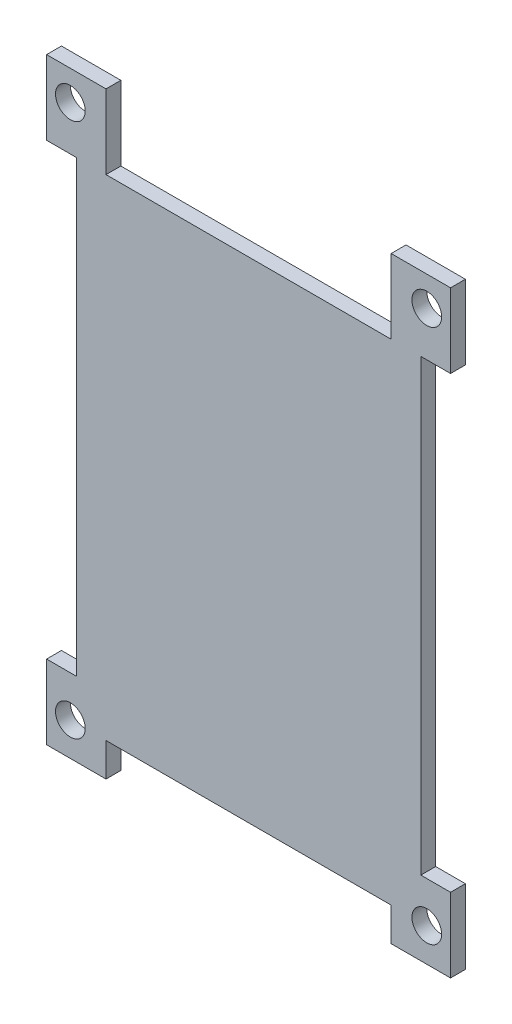
ISO-10303-21;
HEADER;
FILE_DESCRIPTION(('STEP AP214'),'2;1');
FILE_NAME('part.step','',(''),(''),'','','');
FILE_SCHEMA(('AUTOMOTIVE_DESIGN { 1 0 10303 214 1 1 1 1 }'));
ENDSEC;
DATA;
#1=APPLICATION_CONTEXT('core data for automotive mechanical design processes');
#2=APPLICATION_PROTOCOL_DEFINITION('international standard','automotive_design',2000,#1);
#3=PRODUCT_CONTEXT('',#1,'mechanical');
#4=PRODUCT('Part','Part','',(#3));
#5=PRODUCT_RELATED_PRODUCT_CATEGORY('part','',(#4));
#6=PRODUCT_DEFINITION_FORMATION('','',#4);
#7=PRODUCT_DEFINITION_CONTEXT('part definition',#1,'design');
#8=PRODUCT_DEFINITION('design','',#6,#7);
#9=PRODUCT_DEFINITION_SHAPE('','',#8);
#10=(LENGTH_UNIT() NAMED_UNIT(*) SI_UNIT(.MILLI.,.METRE.));
#11=(NAMED_UNIT(*) PLANE_ANGLE_UNIT() SI_UNIT($,.RADIAN.));
#12=(NAMED_UNIT(*) SI_UNIT($,.STERADIAN.) SOLID_ANGLE_UNIT());
#13=UNCERTAINTY_MEASURE_WITH_UNIT(LENGTH_MEASURE(1.E-05),#10,'distance_accuracy_value','');
#14=(GEOMETRIC_REPRESENTATION_CONTEXT(3) GLOBAL_UNCERTAINTY_ASSIGNED_CONTEXT((#13)) GLOBAL_UNIT_ASSIGNED_CONTEXT((#10,
#11,#12)) REPRESENTATION_CONTEXT('',''));
#15=CARTESIAN_POINT('',(0.,0.,0.));
#16=DIRECTION('',(0.,0.,1.));
#17=DIRECTION('',(1.,0.,0.));
#18=AXIS2_PLACEMENT_3D('',#15,#16,#17);
#19=CARTESIAN_POINT('',(-27.2,33.,2.));
#20=DIRECTION('',(0.,1.,0.));
#21=DIRECTION('',(0.,0.,1.));
#22=AXIS2_PLACEMENT_3D('',#19,#20,#21);
#23=PLANE('',#22);
#24=DIRECTION('',(1.,0.,0.));
#25=VECTOR('',#24,1.);
#26=CARTESIAN_POINT('',(-27.2,33.,0.));
#27=LINE('',#26,#25);
#28=CARTESIAN_POINT('',(-27.2,33.,0.));
#29=VERTEX_POINT('',#28);
#30=CARTESIAN_POINT('',(-23.2,33.,0.));
#31=VERTEX_POINT('',#30);
#32=EDGE_CURVE('E202',#29,#31,#27,.T.);
#33=ORIENTED_EDGE('',*,*,#32,.T.);
#34=DIRECTION('',(0.,0.,-1.));
#35=VECTOR('',#34,1.);
#36=CARTESIAN_POINT('',(-23.2,33.,2.));
#37=LINE('',#36,#35);
#38=CARTESIAN_POINT('',(-23.2,33.,2.));
#39=VERTEX_POINT('',#38);
#40=EDGE_CURVE('E11',#39,#31,#37,.T.);
#41=ORIENTED_EDGE('',*,*,#40,.F.);
#42=DIRECTION('',(1.,0.,0.));
#43=VECTOR('',#42,1.);
#44=CARTESIAN_POINT('',(-27.2,33.,2.));
#45=LINE('',#44,#43);
#46=CARTESIAN_POINT('',(-27.2,33.,2.));
#47=VERTEX_POINT('',#46);
#48=EDGE_CURVE('E241',#47,#39,#45,.T.);
#49=ORIENTED_EDGE('',*,*,#48,.F.);
#50=DIRECTION('',(0.,0.,-1.));
#51=VECTOR('',#50,1.);
#52=CARTESIAN_POINT('',(-27.2,33.,2.));
#53=LINE('',#52,#51);
#54=EDGE_CURVE('E198',#47,#29,#53,.T.);
#55=ORIENTED_EDGE('',*,*,#54,.T.);
#56=EDGE_LOOP('',(#33,#41,#49,#55));
#57=FACE_BOUND('',#56,.T.);
#58=ADVANCED_FACE('F34',(#57),#23,.F.);
#59=CARTESIAN_POINT('',(-23.2,33.,2.));
#60=DIRECTION('',(1.,0.,0.));
#61=DIRECTION('',(0.,1.,0.));
#62=AXIS2_PLACEMENT_3D('',#59,#60,#61);
#63=PLANE('',#62);
#64=DIRECTION('',(0.,-1.,0.));
#65=VECTOR('',#64,1.);
#66=CARTESIAN_POINT('',(-23.2,33.,0.));
#67=LINE('',#66,#65);
#68=CARTESIAN_POINT('',(-23.2,-27.5,0.));
#69=VERTEX_POINT('',#68);
#70=EDGE_CURVE('E205',#31,#69,#67,.T.);
#71=ORIENTED_EDGE('',*,*,#70,.T.);
#72=DIRECTION('',(0.,0.,-1.));
#73=VECTOR('',#72,1.);
#74=CARTESIAN_POINT('',(-23.2,-27.5,2.));
#75=LINE('',#74,#73);
#76=CARTESIAN_POINT('',(-23.2,-27.5,2.));
#77=VERTEX_POINT('',#76);
#78=EDGE_CURVE('E42',#77,#69,#75,.T.);
#79=ORIENTED_EDGE('',*,*,#78,.F.);
#80=DIRECTION('',(0.,-1.,0.));
#81=VECTOR('',#80,1.);
#82=CARTESIAN_POINT('',(-23.2,33.,2.));
#83=LINE('',#82,#81);
#84=EDGE_CURVE('E129',#39,#77,#83,.T.);
#85=ORIENTED_EDGE('',*,*,#84,.F.);
#86=ORIENTED_EDGE('',*,*,#40,.T.);
#87=EDGE_LOOP('',(#71,#79,#85,#86));
#88=FACE_BOUND('',#87,.T.);
#89=ADVANCED_FACE('F360',(#88),#63,.F.);
#90=CARTESIAN_POINT('',(-27.2,-27.5,2.));
#91=DIRECTION('',(0.,-1.,0.));
#92=DIRECTION('',(0.,0.,-1.));
#93=AXIS2_PLACEMENT_3D('',#90,#91,#92);
#94=PLANE('',#93);
#95=DIRECTION('',(-1.,0.,0.));
#96=VECTOR('',#95,1.);
#97=CARTESIAN_POINT('',(-27.2,-27.5,0.));
#98=LINE('',#97,#96);
#99=CARTESIAN_POINT('',(-27.2,-27.5,0.));
#100=VERTEX_POINT('',#99);
#101=EDGE_CURVE('E208',#69,#100,#98,.T.);
#102=ORIENTED_EDGE('',*,*,#101,.T.);
#103=DIRECTION('',(0.,0.,-1.));
#104=VECTOR('',#103,1.);
#105=CARTESIAN_POINT('',(-27.2,-27.5,2.));
#106=LINE('',#105,#104);
#107=CARTESIAN_POINT('',(-27.2,-27.5,2.));
#108=VERTEX_POINT('',#107);
#109=EDGE_CURVE('E284',#108,#100,#106,.T.);
#110=ORIENTED_EDGE('',*,*,#109,.F.);
#111=DIRECTION('',(-1.,0.,0.));
#112=VECTOR('',#111,1.);
#113=CARTESIAN_POINT('',(-27.2,-27.5,2.));
#114=LINE('',#113,#112);
#115=EDGE_CURVE('E292',#77,#108,#114,.T.);
#116=ORIENTED_EDGE('',*,*,#115,.F.);
#117=ORIENTED_EDGE('',*,*,#78,.T.);
#118=EDGE_LOOP('',(#102,#110,#116,#117));
#119=FACE_BOUND('',#118,.T.);
#120=ADVANCED_FACE('F290',(#119),#94,.F.);
#121=CARTESIAN_POINT('',(-27.2,-37.5,2.));
#122=DIRECTION('',(1.,0.,0.));
#123=DIRECTION('',(0.,0.,-1.));
#124=AXIS2_PLACEMENT_3D('',#121,#122,#123);
#125=PLANE('',#124);
#126=DIRECTION('',(0.,-1.,0.));
#127=VECTOR('',#126,1.);
#128=CARTESIAN_POINT('',(-27.2,-37.5,0.));
#129=LINE('',#128,#127);
#130=CARTESIAN_POINT('',(-27.2,-37.5,0.));
#131=VERTEX_POINT('',#130);
#132=EDGE_CURVE('E210',#100,#131,#129,.T.);
#133=ORIENTED_EDGE('',*,*,#132,.T.);
#134=DIRECTION('',(0.,0.,-1.));
#135=VECTOR('',#134,1.);
#136=CARTESIAN_POINT('',(-27.2,-37.5,2.));
#137=LINE('',#136,#135);
#138=CARTESIAN_POINT('',(-27.2,-37.5,2.));
#139=VERTEX_POINT('',#138);
#140=EDGE_CURVE('E281',#139,#131,#137,.T.);
#141=ORIENTED_EDGE('',*,*,#140,.F.);
#142=DIRECTION('',(0.,-1.,0.));
#143=VECTOR('',#142,1.);
#144=CARTESIAN_POINT('',(-27.2,-37.5,2.));
#145=LINE('',#144,#143);
#146=EDGE_CURVE('E310',#108,#139,#145,.T.);
#147=ORIENTED_EDGE('',*,*,#146,.F.);
#148=ORIENTED_EDGE('',*,*,#109,.T.);
#149=EDGE_LOOP('',(#133,#141,#147,#148));
#150=FACE_BOUND('',#149,.T.);
#151=ADVANCED_FACE('F301',(#150),#125,.F.);
#152=CARTESIAN_POINT('',(-19.2,-37.5,2.));
#153=DIRECTION('',(0.,1.,0.));
#154=DIRECTION('',(-1.,0.,0.));
#155=AXIS2_PLACEMENT_3D('',#152,#153,#154);
#156=PLANE('',#155);
#157=DIRECTION('',(1.,0.,0.));
#158=VECTOR('',#157,1.);
#159=CARTESIAN_POINT('',(-19.2,-37.5,0.));
#160=LINE('',#159,#158);
#161=CARTESIAN_POINT('',(-19.2,-37.5,0.));
#162=VERTEX_POINT('',#161);
#163=EDGE_CURVE('E212',#131,#162,#160,.T.);
#164=ORIENTED_EDGE('',*,*,#163,.T.);
#165=DIRECTION('',(0.,0.,-1.));
#166=VECTOR('',#165,1.);
#167=CARTESIAN_POINT('',(-19.2,-37.5,2.));
#168=LINE('',#167,#166);
#169=CARTESIAN_POINT('',(-19.2,-37.5,2.));
#170=VERTEX_POINT('',#169);
#171=EDGE_CURVE('E278',#170,#162,#168,.T.);
#172=ORIENTED_EDGE('',*,*,#171,.F.);
#173=DIRECTION('',(1.,0.,0.));
#174=VECTOR('',#173,1.);
#175=CARTESIAN_POINT('',(-19.2,-37.5,2.));
#176=LINE('',#175,#174);
#177=EDGE_CURVE('E307',#139,#170,#176,.T.);
#178=ORIENTED_EDGE('',*,*,#177,.F.);
#179=ORIENTED_EDGE('',*,*,#140,.T.);
#180=EDGE_LOOP('',(#164,#172,#178,#179));
#181=FACE_BOUND('',#180,.T.);
#182=ADVANCED_FACE('F305',(#181),#156,.F.);
#183=CARTESIAN_POINT('',(-19.2,-37.5,2.));
#184=DIRECTION('',(-1.,0.,0.));
#185=DIRECTION('',(0.,-1.,0.));
#186=AXIS2_PLACEMENT_3D('',#183,#184,#185);
#187=PLANE('',#186);
#188=DIRECTION('',(0.,1.,0.));
#189=VECTOR('',#188,1.);
#190=CARTESIAN_POINT('',(-19.2,-37.5,0.));
#191=LINE('',#190,#189);
#192=CARTESIAN_POINT('',(-19.2,-33.,0.));
#193=VERTEX_POINT('',#192);
#194=EDGE_CURVE('E214',#162,#193,#191,.T.);
#195=ORIENTED_EDGE('',*,*,#194,.T.);
#196=DIRECTION('',(0.,0.,-1.));
#197=VECTOR('',#196,1.);
#198=CARTESIAN_POINT('',(-19.2,-33.,2.));
#199=LINE('',#198,#197);
#200=CARTESIAN_POINT('',(-19.2,-33.,2.));
#201=VERTEX_POINT('',#200);
#202=EDGE_CURVE('E275',#201,#193,#199,.T.);
#203=ORIENTED_EDGE('',*,*,#202,.F.);
#204=DIRECTION('',(0.,1.,0.));
#205=VECTOR('',#204,1.);
#206=CARTESIAN_POINT('',(-19.2,-37.5,2.));
#207=LINE('',#206,#205);
#208=EDGE_CURVE('E309',#170,#201,#207,.T.);
#209=ORIENTED_EDGE('',*,*,#208,.F.);
#210=ORIENTED_EDGE('',*,*,#171,.T.);
#211=EDGE_LOOP('',(#195,#203,#209,#210));
#212=FACE_BOUND('',#211,.T.);
#213=ADVANCED_FACE('F373',(#212),#187,.F.);
#214=CARTESIAN_POINT('',(19.2,-33.,2.));
#215=DIRECTION('',(0.,1.,0.));
#216=DIRECTION('',(0.,0.,1.));
#217=AXIS2_PLACEMENT_3D('',#214,#215,#216);
#218=PLANE('',#217);
#219=DIRECTION('',(1.,0.,0.));
#220=VECTOR('',#219,1.);
#221=CARTESIAN_POINT('',(19.2,-33.,0.));
#222=LINE('',#221,#220);
#223=CARTESIAN_POINT('',(19.2,-33.,0.));
#224=VERTEX_POINT('',#223);
#225=EDGE_CURVE('E216',#193,#224,#222,.T.);
#226=ORIENTED_EDGE('',*,*,#225,.T.);
#227=DIRECTION('',(0.,0.,-1.));
#228=VECTOR('',#227,1.);
#229=CARTESIAN_POINT('',(19.2,-33.,2.));
#230=LINE('',#229,#228);
#231=CARTESIAN_POINT('',(19.2,-33.,2.));
#232=VERTEX_POINT('',#231);
#233=EDGE_CURVE('E272',#232,#224,#230,.T.);
#234=ORIENTED_EDGE('',*,*,#233,.F.);
#235=DIRECTION('',(1.,0.,0.));
#236=VECTOR('',#235,1.);
#237=CARTESIAN_POINT('',(19.2,-33.,2.));
#238=LINE('',#237,#236);
#239=EDGE_CURVE('E312',#201,#232,#238,.T.);
#240=ORIENTED_EDGE('',*,*,#239,.F.);
#241=ORIENTED_EDGE('',*,*,#202,.T.);
#242=EDGE_LOOP('',(#226,#234,#240,#241));
#243=FACE_BOUND('',#242,.T.);
#244=ADVANCED_FACE('F376',(#243),#218,.F.);
#245=CARTESIAN_POINT('',(19.2,-37.5,2.));
#246=DIRECTION('',(1.,0.,0.));
#247=DIRECTION('',(0.,0.,-1.));
#248=AXIS2_PLACEMENT_3D('',#245,#246,#247);
#249=PLANE('',#248);
#250=DIRECTION('',(0.,-1.,0.));
#251=VECTOR('',#250,1.);
#252=CARTESIAN_POINT('',(19.2,-37.5,0.));
#253=LINE('',#252,#251);
#254=CARTESIAN_POINT('',(19.2,-37.5,0.));
#255=VERTEX_POINT('',#254);
#256=EDGE_CURVE('E218',#224,#255,#253,.T.);
#257=ORIENTED_EDGE('',*,*,#256,.T.);
#258=DIRECTION('',(0.,0.,-1.));
#259=VECTOR('',#258,1.);
#260=CARTESIAN_POINT('',(19.2,-37.5,2.));
#261=LINE('',#260,#259);
#262=CARTESIAN_POINT('',(19.2,-37.5,2.));
#263=VERTEX_POINT('',#262);
#264=EDGE_CURVE('E269',#263,#255,#261,.T.);
#265=ORIENTED_EDGE('',*,*,#264,.F.);
#266=DIRECTION('',(0.,-1.,0.));
#267=VECTOR('',#266,1.);
#268=CARTESIAN_POINT('',(19.2,-37.5,2.));
#269=LINE('',#268,#267);
#270=EDGE_CURVE('E318',#232,#263,#269,.T.);
#271=ORIENTED_EDGE('',*,*,#270,.F.);
#272=ORIENTED_EDGE('',*,*,#233,.T.);
#273=EDGE_LOOP('',(#257,#265,#271,#272));
#274=FACE_BOUND('',#273,.T.);
#275=ADVANCED_FACE('F380',(#274),#249,.F.);
#276=CARTESIAN_POINT('',(19.2,-37.5,2.));
#277=DIRECTION('',(0.,1.,0.));
#278=DIRECTION('',(-1.,0.,0.));
#279=AXIS2_PLACEMENT_3D('',#276,#277,#278);
#280=PLANE('',#279);
#281=DIRECTION('',(1.,0.,0.));
#282=VECTOR('',#281,1.);
#283=CARTESIAN_POINT('',(19.2,-37.5,0.));
#284=LINE('',#283,#282);
#285=CARTESIAN_POINT('',(27.2,-37.5,0.));
#286=VERTEX_POINT('',#285);
#287=EDGE_CURVE('E220',#255,#286,#284,.T.);
#288=ORIENTED_EDGE('',*,*,#287,.T.);
#289=DIRECTION('',(0.,0.,-1.));
#290=VECTOR('',#289,1.);
#291=CARTESIAN_POINT('',(27.2,-37.5,2.));
#292=LINE('',#291,#290);
#293=CARTESIAN_POINT('',(27.2,-37.5,2.));
#294=VERTEX_POINT('',#293);
#295=EDGE_CURVE('E266',#294,#286,#292,.T.);
#296=ORIENTED_EDGE('',*,*,#295,.F.);
#297=DIRECTION('',(1.,0.,0.));
#298=VECTOR('',#297,1.);
#299=CARTESIAN_POINT('',(19.2,-37.5,2.));
#300=LINE('',#299,#298);
#301=EDGE_CURVE('E320',#263,#294,#300,.T.);
#302=ORIENTED_EDGE('',*,*,#301,.F.);
#303=ORIENTED_EDGE('',*,*,#264,.T.);
#304=EDGE_LOOP('',(#288,#296,#302,#303));
#305=FACE_BOUND('',#304,.T.);
#306=ADVANCED_FACE('F384',(#305),#280,.F.);
#307=CARTESIAN_POINT('',(27.2,-37.5,2.));
#308=DIRECTION('',(-1.,0.,0.));
#309=DIRECTION('',(0.,0.,1.));
#310=AXIS2_PLACEMENT_3D('',#307,#308,#309);
#311=PLANE('',#310);
#312=DIRECTION('',(0.,1.,0.));
#313=VECTOR('',#312,1.);
#314=CARTESIAN_POINT('',(27.2,-37.5,0.));
#315=LINE('',#314,#313);
#316=CARTESIAN_POINT('',(27.2,-27.5,0.));
#317=VERTEX_POINT('',#316);
#318=EDGE_CURVE('E222',#286,#317,#315,.T.);
#319=ORIENTED_EDGE('',*,*,#318,.T.);
#320=DIRECTION('',(0.,0.,-1.));
#321=VECTOR('',#320,1.);
#322=CARTESIAN_POINT('',(27.2,-27.5,2.));
#323=LINE('',#322,#321);
#324=CARTESIAN_POINT('',(27.2,-27.5,2.));
#325=VERTEX_POINT('',#324);
#326=EDGE_CURVE('E263',#325,#317,#323,.T.);
#327=ORIENTED_EDGE('',*,*,#326,.F.);
#328=DIRECTION('',(0.,1.,0.));
#329=VECTOR('',#328,1.);
#330=CARTESIAN_POINT('',(27.2,-37.5,2.));
#331=LINE('',#330,#329);
#332=EDGE_CURVE('E322',#294,#325,#331,.T.);
#333=ORIENTED_EDGE('',*,*,#332,.F.);
#334=ORIENTED_EDGE('',*,*,#295,.T.);
#335=EDGE_LOOP('',(#319,#327,#333,#334));
#336=FACE_BOUND('',#335,.T.);
#337=ADVANCED_FACE('F388',(#336),#311,.F.);
#338=CARTESIAN_POINT('',(27.2,-27.5,2.));
#339=DIRECTION('',(0.,-1.,0.));
#340=DIRECTION('',(0.,0.,-1.));
#341=AXIS2_PLACEMENT_3D('',#338,#339,#340);
#342=PLANE('',#341);
#343=DIRECTION('',(-1.,0.,0.));
#344=VECTOR('',#343,1.);
#345=CARTESIAN_POINT('',(27.2,-27.5,0.));
#346=LINE('',#345,#344);
#347=CARTESIAN_POINT('',(23.2,-27.5,0.));
#348=VERTEX_POINT('',#347);
#349=EDGE_CURVE('E224',#317,#348,#346,.T.);
#350=ORIENTED_EDGE('',*,*,#349,.T.);
#351=DIRECTION('',(0.,0.,-1.));
#352=VECTOR('',#351,1.);
#353=CARTESIAN_POINT('',(23.2,-27.5,2.));
#354=LINE('',#353,#352);
#355=CARTESIAN_POINT('',(23.2,-27.5,2.));
#356=VERTEX_POINT('',#355);
#357=EDGE_CURVE('E260',#356,#348,#354,.T.);
#358=ORIENTED_EDGE('',*,*,#357,.F.);
#359=DIRECTION('',(-1.,0.,0.));
#360=VECTOR('',#359,1.);
#361=CARTESIAN_POINT('',(27.2,-27.5,2.));
#362=LINE('',#361,#360);
#363=EDGE_CURVE('E324',#325,#356,#362,.T.);
#364=ORIENTED_EDGE('',*,*,#363,.F.);
#365=ORIENTED_EDGE('',*,*,#326,.T.);
#366=EDGE_LOOP('',(#350,#358,#364,#365));
#367=FACE_BOUND('',#366,.T.);
#368=ADVANCED_FACE('F392',(#367),#342,.F.);
#369=CARTESIAN_POINT('',(23.2,33.,2.));
#370=DIRECTION('',(-1.,0.,0.));
#371=DIRECTION('',(0.,-1.,0.));
#372=AXIS2_PLACEMENT_3D('',#369,#370,#371);
#373=PLANE('',#372);
#374=DIRECTION('',(0.,1.,0.));
#375=VECTOR('',#374,1.);
#376=CARTESIAN_POINT('',(23.2,33.,0.));
#377=LINE('',#376,#375);
#378=CARTESIAN_POINT('',(23.2,33.,0.));
#379=VERTEX_POINT('',#378);
#380=EDGE_CURVE('E226',#348,#379,#377,.T.);
#381=ORIENTED_EDGE('',*,*,#380,.T.);
#382=DIRECTION('',(0.,0.,-1.));
#383=VECTOR('',#382,1.);
#384=CARTESIAN_POINT('',(23.2,33.,2.));
#385=LINE('',#384,#383);
#386=CARTESIAN_POINT('',(23.2,33.,2.));
#387=VERTEX_POINT('',#386);
#388=EDGE_CURVE('E257',#387,#379,#385,.T.);
#389=ORIENTED_EDGE('',*,*,#388,.F.);
#390=DIRECTION('',(0.,1.,0.));
#391=VECTOR('',#390,1.);
#392=CARTESIAN_POINT('',(23.2,33.,2.));
#393=LINE('',#392,#391);
#394=EDGE_CURVE('E326',#356,#387,#393,.T.);
#395=ORIENTED_EDGE('',*,*,#394,.F.);
#396=ORIENTED_EDGE('',*,*,#357,.T.);
#397=EDGE_LOOP('',(#381,#389,#395,#396));
#398=FACE_BOUND('',#397,.T.);
#399=ADVANCED_FACE('F396',(#398),#373,.F.);
#400=CARTESIAN_POINT('',(23.2,33.,2.));
#401=DIRECTION('',(0.,1.,0.));
#402=DIRECTION('',(0.,0.,1.));
#403=AXIS2_PLACEMENT_3D('',#400,#401,#402);
#404=PLANE('',#403);
#405=DIRECTION('',(1.,0.,0.));
#406=VECTOR('',#405,1.);
#407=CARTESIAN_POINT('',(23.2,33.,0.));
#408=LINE('',#407,#406);
#409=CARTESIAN_POINT('',(27.2,33.,0.));
#410=VERTEX_POINT('',#409);
#411=EDGE_CURVE('E228',#379,#410,#408,.T.);
#412=ORIENTED_EDGE('',*,*,#411,.T.);
#413=DIRECTION('',(0.,0.,-1.));
#414=VECTOR('',#413,1.);
#415=CARTESIAN_POINT('',(27.2,33.,2.));
#416=LINE('',#415,#414);
#417=CARTESIAN_POINT('',(27.2,33.,2.));
#418=VERTEX_POINT('',#417);
#419=EDGE_CURVE('E254',#418,#410,#416,.T.);
#420=ORIENTED_EDGE('',*,*,#419,.F.);
#421=DIRECTION('',(1.,0.,0.));
#422=VECTOR('',#421,1.);
#423=CARTESIAN_POINT('',(23.2,33.,2.));
#424=LINE('',#423,#422);
#425=EDGE_CURVE('E328',#387,#418,#424,.T.);
#426=ORIENTED_EDGE('',*,*,#425,.F.);
#427=ORIENTED_EDGE('',*,*,#388,.T.);
#428=EDGE_LOOP('',(#412,#420,#426,#427));
#429=FACE_BOUND('',#428,.T.);
#430=ADVANCED_FACE('F400',(#429),#404,.F.);
#431=CARTESIAN_POINT('',(27.2,43.,2.));
#432=DIRECTION('',(-1.,0.,0.));
#433=DIRECTION('',(0.,0.,1.));
#434=AXIS2_PLACEMENT_3D('',#431,#432,#433);
#435=PLANE('',#434);
#436=DIRECTION('',(0.,1.,0.));
#437=VECTOR('',#436,1.);
#438=CARTESIAN_POINT('',(27.2,43.,0.));
#439=LINE('',#438,#437);
#440=CARTESIAN_POINT('',(27.2,43.,0.));
#441=VERTEX_POINT('',#440);
#442=EDGE_CURVE('E230',#410,#441,#439,.T.);
#443=ORIENTED_EDGE('',*,*,#442,.T.);
#444=DIRECTION('',(0.,0.,-1.));
#445=VECTOR('',#444,1.);
#446=CARTESIAN_POINT('',(27.2,43.,2.));
#447=LINE('',#446,#445);
#448=CARTESIAN_POINT('',(27.2,43.,2.));
#449=VERTEX_POINT('',#448);
#450=EDGE_CURVE('E251',#449,#441,#447,.T.);
#451=ORIENTED_EDGE('',*,*,#450,.F.);
#452=DIRECTION('',(0.,1.,0.));
#453=VECTOR('',#452,1.);
#454=CARTESIAN_POINT('',(27.2,43.,2.));
#455=LINE('',#454,#453);
#456=EDGE_CURVE('E330',#418,#449,#455,.T.);
#457=ORIENTED_EDGE('',*,*,#456,.F.);
#458=ORIENTED_EDGE('',*,*,#419,.T.);
#459=EDGE_LOOP('',(#443,#451,#457,#458));
#460=FACE_BOUND('',#459,.T.);
#461=ADVANCED_FACE('F404',(#460),#435,.F.);
#462=CARTESIAN_POINT('',(27.2,43.,2.));
#463=DIRECTION('',(0.,-1.,0.));
#464=DIRECTION('',(0.,0.,-1.));
#465=AXIS2_PLACEMENT_3D('',#462,#463,#464);
#466=PLANE('',#465);
#467=DIRECTION('',(-1.,0.,0.));
#468=VECTOR('',#467,1.);
#469=CARTESIAN_POINT('',(27.2,43.,0.));
#470=LINE('',#469,#468);
#471=CARTESIAN_POINT('',(19.2,43.,0.));
#472=VERTEX_POINT('',#471);
#473=EDGE_CURVE('E232',#441,#472,#470,.T.);
#474=ORIENTED_EDGE('',*,*,#473,.T.);
#475=DIRECTION('',(0.,0.,-1.));
#476=VECTOR('',#475,1.);
#477=CARTESIAN_POINT('',(19.2,43.,2.));
#478=LINE('',#477,#476);
#479=CARTESIAN_POINT('',(19.2,43.,2.));
#480=VERTEX_POINT('',#479);
#481=EDGE_CURVE('E248',#480,#472,#478,.T.);
#482=ORIENTED_EDGE('',*,*,#481,.F.);
#483=DIRECTION('',(-1.,0.,0.));
#484=VECTOR('',#483,1.);
#485=CARTESIAN_POINT('',(27.2,43.,2.));
#486=LINE('',#485,#484);
#487=EDGE_CURVE('E332',#449,#480,#486,.T.);
#488=ORIENTED_EDGE('',*,*,#487,.F.);
#489=ORIENTED_EDGE('',*,*,#450,.T.);
#490=EDGE_LOOP('',(#474,#482,#488,#489));
#491=FACE_BOUND('',#490,.T.);
#492=ADVANCED_FACE('F408',(#491),#466,.F.);
#493=CARTESIAN_POINT('',(19.2,43.,2.));
#494=DIRECTION('',(1.,0.,0.));
#495=DIRECTION('',(0.,1.,0.));
#496=AXIS2_PLACEMENT_3D('',#493,#494,#495);
#497=PLANE('',#496);
#498=DIRECTION('',(0.,-1.,0.));
#499=VECTOR('',#498,1.);
#500=CARTESIAN_POINT('',(19.2,43.,0.));
#501=LINE('',#500,#499);
#502=CARTESIAN_POINT('',(19.2,33.,0.));
#503=VERTEX_POINT('',#502);
#504=EDGE_CURVE('E234',#472,#503,#501,.T.);
#505=ORIENTED_EDGE('',*,*,#504,.T.);
#506=DIRECTION('',(0.,0.,-1.));
#507=VECTOR('',#506,1.);
#508=CARTESIAN_POINT('',(19.2,33.,2.));
#509=LINE('',#508,#507);
#510=CARTESIAN_POINT('',(19.2,33.,2.));
#511=VERTEX_POINT('',#510);
#512=EDGE_CURVE('E245',#511,#503,#509,.T.);
#513=ORIENTED_EDGE('',*,*,#512,.F.);
#514=DIRECTION('',(0.,-1.,0.));
#515=VECTOR('',#514,1.);
#516=CARTESIAN_POINT('',(19.2,43.,2.));
#517=LINE('',#516,#515);
#518=EDGE_CURVE('E334',#480,#511,#517,.T.);
#519=ORIENTED_EDGE('',*,*,#518,.F.);
#520=ORIENTED_EDGE('',*,*,#481,.T.);
#521=EDGE_LOOP('',(#505,#513,#519,#520));
#522=FACE_BOUND('',#521,.T.);
#523=ADVANCED_FACE('F340',(#522),#497,.F.);
#524=CARTESIAN_POINT('',(-19.2,33.,2.));
#525=DIRECTION('',(0.,-1.,0.));
#526=DIRECTION('',(0.,0.,-1.));
#527=AXIS2_PLACEMENT_3D('',#524,#525,#526);
#528=PLANE('',#527);
#529=DIRECTION('',(-1.,0.,0.));
#530=VECTOR('',#529,1.);
#531=CARTESIAN_POINT('',(-19.2,33.,0.));
#532=LINE('',#531,#530);
#533=CARTESIAN_POINT('',(-19.2,33.,0.));
#534=VERTEX_POINT('',#533);
#535=EDGE_CURVE('E236',#503,#534,#532,.T.);
#536=ORIENTED_EDGE('',*,*,#535,.T.);
#537=DIRECTION('',(0.,0.,-1.));
#538=VECTOR('',#537,1.);
#539=CARTESIAN_POINT('',(-19.2,33.,2.));
#540=LINE('',#539,#538);
#541=CARTESIAN_POINT('',(-19.2,33.,2.));
#542=VERTEX_POINT('',#541);
#543=EDGE_CURVE('E193',#542,#534,#540,.T.);
#544=ORIENTED_EDGE('',*,*,#543,.F.);
#545=DIRECTION('',(-1.,0.,0.));
#546=VECTOR('',#545,1.);
#547=CARTESIAN_POINT('',(-19.2,33.,2.));
#548=LINE('',#547,#546);
#549=EDGE_CURVE('E184',#511,#542,#548,.T.);
#550=ORIENTED_EDGE('',*,*,#549,.F.);
#551=ORIENTED_EDGE('',*,*,#512,.T.);
#552=EDGE_LOOP('',(#536,#544,#550,#551));
#553=FACE_BOUND('',#552,.T.);
#554=ADVANCED_FACE('F344',(#553),#528,.F.);
#555=CARTESIAN_POINT('',(-19.2,43.,2.));
#556=DIRECTION('',(-1.,0.,0.));
#557=DIRECTION('',(0.,-1.,0.));
#558=AXIS2_PLACEMENT_3D('',#555,#556,#557);
#559=PLANE('',#558);
#560=DIRECTION('',(0.,1.,0.));
#561=VECTOR('',#560,1.);
#562=CARTESIAN_POINT('',(-19.2,43.,0.));
#563=LINE('',#562,#561);
#564=CARTESIAN_POINT('',(-19.2,43.,0.));
#565=VERTEX_POINT('',#564);
#566=EDGE_CURVE('E192',#534,#565,#563,.T.);
#567=ORIENTED_EDGE('',*,*,#566,.T.);
#568=DIRECTION('',(0.,0.,-1.));
#569=VECTOR('',#568,1.);
#570=CARTESIAN_POINT('',(-19.2,43.,2.));
#571=LINE('',#570,#569);
#572=CARTESIAN_POINT('',(-19.2,43.,2.));
#573=VERTEX_POINT('',#572);
#574=EDGE_CURVE('E189',#573,#565,#571,.T.);
#575=ORIENTED_EDGE('',*,*,#574,.F.);
#576=DIRECTION('',(0.,1.,0.));
#577=VECTOR('',#576,1.);
#578=CARTESIAN_POINT('',(-19.2,43.,2.));
#579=LINE('',#578,#577);
#580=EDGE_CURVE('E178',#542,#573,#579,.T.);
#581=ORIENTED_EDGE('',*,*,#580,.F.);
#582=ORIENTED_EDGE('',*,*,#543,.T.);
#583=EDGE_LOOP('',(#567,#575,#581,#582));
#584=FACE_BOUND('',#583,.T.);
#585=ADVANCED_FACE('F190',(#584),#559,.F.);
#586=CARTESIAN_POINT('',(-27.2,43.,2.));
#587=DIRECTION('',(0.,-1.,0.));
#588=DIRECTION('',(0.,0.,-1.));
#589=AXIS2_PLACEMENT_3D('',#586,#587,#588);
#590=PLANE('',#589);
#591=DIRECTION('',(-1.,0.,0.));
#592=VECTOR('',#591,1.);
#593=CARTESIAN_POINT('',(-27.2,43.,0.));
#594=LINE('',#593,#592);
#595=CARTESIAN_POINT('',(-27.2,43.,0.));
#596=VERTEX_POINT('',#595);
#597=EDGE_CURVE('E115',#565,#596,#594,.T.);
#598=ORIENTED_EDGE('',*,*,#597,.T.);
#599=DIRECTION('',(0.,0.,-1.));
#600=VECTOR('',#599,1.);
#601=CARTESIAN_POINT('',(-27.2,43.,2.));
#602=LINE('',#601,#600);
#603=CARTESIAN_POINT('',(-27.2,43.,2.));
#604=VERTEX_POINT('',#603);
#605=EDGE_CURVE('E194',#604,#596,#602,.T.);
#606=ORIENTED_EDGE('',*,*,#605,.F.);
#607=DIRECTION('',(-1.,0.,0.));
#608=VECTOR('',#607,1.);
#609=CARTESIAN_POINT('',(-27.2,43.,2.));
#610=LINE('',#609,#608);
#611=EDGE_CURVE('E182',#573,#604,#610,.T.);
#612=ORIENTED_EDGE('',*,*,#611,.F.);
#613=ORIENTED_EDGE('',*,*,#574,.T.);
#614=EDGE_LOOP('',(#598,#606,#612,#613));
#615=FACE_BOUND('',#614,.T.);
#616=ADVANCED_FACE('F196',(#615),#590,.F.);
#617=CARTESIAN_POINT('',(-27.2,43.,2.));
#618=DIRECTION('',(1.,0.,0.));
#619=DIRECTION('',(0.,0.,-1.));
#620=AXIS2_PLACEMENT_3D('',#617,#618,#619);
#621=PLANE('',#620);
#622=DIRECTION('',(0.,-1.,0.));
#623=VECTOR('',#622,1.);
#624=CARTESIAN_POINT('',(-27.2,43.,0.));
#625=LINE('',#624,#623);
#626=EDGE_CURVE('E121',#596,#29,#625,.T.);
#627=ORIENTED_EDGE('',*,*,#626,.T.);
#628=ORIENTED_EDGE('',*,*,#54,.F.);
#629=DIRECTION('',(0.,-1.,0.));
#630=VECTOR('',#629,1.);
#631=CARTESIAN_POINT('',(-27.2,43.,2.));
#632=LINE('',#631,#630);
#633=EDGE_CURVE('E50',#604,#47,#632,.T.);
#634=ORIENTED_EDGE('',*,*,#633,.F.);
#635=ORIENTED_EDGE('',*,*,#605,.T.);
#636=EDGE_LOOP('',(#627,#628,#634,#635));
#637=FACE_BOUND('',#636,.T.);
#638=ADVANCED_FACE('F348',(#637),#621,.F.);
#639=CARTESIAN_POINT('',(-27.2,33.,2.));
#640=DIRECTION('',(0.,0.,1.));
#641=DIRECTION('',(1.,0.,0.));
#642=AXIS2_PLACEMENT_3D('',#639,#640,#641);
#643=PLANE('',#642);
#644=CARTESIAN_POINT('',(24.,-33.,2.));
#645=DIRECTION('',(0.,0.,1.));
#646=DIRECTION('',(1.,0.,0.));
#647=AXIS2_PLACEMENT_3D('',#644,#645,#646);
#648=CIRCLE('',#647,2.00000000000001);
#649=CARTESIAN_POINT('',(26.,-33.,2.));
#650=VERTEX_POINT('',#649);
#651=EDGE_CURVE('E506',#650,#650,#648,.T.);
#652=ORIENTED_EDGE('',*,*,#651,.F.);
#653=EDGE_LOOP('',(#652));
#654=FACE_BOUND('',#653,.T.);
#655=CARTESIAN_POINT('',(-24.,-33.,2.));
#656=DIRECTION('',(0.,0.,1.));
#657=DIRECTION('',(1.,0.,0.));
#658=AXIS2_PLACEMENT_3D('',#655,#656,#657);
#659=CIRCLE('',#658,2.00000000000001);
#660=CARTESIAN_POINT('',(-22.,-33.,2.));
#661=VERTEX_POINT('',#660);
#662=EDGE_CURVE('E508',#661,#661,#659,.T.);
#663=ORIENTED_EDGE('',*,*,#662,.F.);
#664=EDGE_LOOP('',(#663));
#665=FACE_BOUND('',#664,.T.);
#666=CARTESIAN_POINT('',(24.,39.,2.));
#667=DIRECTION('',(0.,0.,1.));
#668=DIRECTION('',(-1.,0.,0.));
#669=AXIS2_PLACEMENT_3D('',#666,#667,#668);
#670=CIRCLE('',#669,2.00000000000001);
#671=CARTESIAN_POINT('',(22.,39.,2.));
#672=VERTEX_POINT('',#671);
#673=EDGE_CURVE('E514',#672,#672,#670,.T.);
#674=ORIENTED_EDGE('',*,*,#673,.F.);
#675=EDGE_LOOP('',(#674));
#676=FACE_BOUND('',#675,.T.);
#677=CARTESIAN_POINT('',(-24.,39.,2.));
#678=DIRECTION('',(0.,0.,1.));
#679=DIRECTION('',(1.,0.,0.));
#680=AXIS2_PLACEMENT_3D('',#677,#678,#679);
#681=CIRCLE('',#680,2.00000000000001);
#682=CARTESIAN_POINT('',(-22.,39.,2.));
#683=VERTEX_POINT('',#682);
#684=EDGE_CURVE('E520',#683,#683,#681,.T.);
#685=ORIENTED_EDGE('',*,*,#684,.F.);
#686=EDGE_LOOP('',(#685));
#687=FACE_BOUND('',#686,.T.);
#688=ORIENTED_EDGE('',*,*,#48,.T.);
#689=ORIENTED_EDGE('',*,*,#84,.T.);
#690=ORIENTED_EDGE('',*,*,#115,.T.);
#691=ORIENTED_EDGE('',*,*,#146,.T.);
#692=ORIENTED_EDGE('',*,*,#177,.T.);
#693=ORIENTED_EDGE('',*,*,#208,.T.);
#694=ORIENTED_EDGE('',*,*,#239,.T.);
#695=ORIENTED_EDGE('',*,*,#270,.T.);
#696=ORIENTED_EDGE('',*,*,#301,.T.);
#697=ORIENTED_EDGE('',*,*,#332,.T.);
#698=ORIENTED_EDGE('',*,*,#363,.T.);
#699=ORIENTED_EDGE('',*,*,#394,.T.);
#700=ORIENTED_EDGE('',*,*,#425,.T.);
#701=ORIENTED_EDGE('',*,*,#456,.T.);
#702=ORIENTED_EDGE('',*,*,#487,.T.);
#703=ORIENTED_EDGE('',*,*,#518,.T.);
#704=ORIENTED_EDGE('',*,*,#549,.T.);
#705=ORIENTED_EDGE('',*,*,#580,.T.);
#706=ORIENTED_EDGE('',*,*,#611,.T.);
#707=ORIENTED_EDGE('',*,*,#633,.T.);
#708=EDGE_LOOP('',(#688,#689,#690,#691,#692,#693,#694,#695,#696,#697,#698,#699,#700,#701,#702,
#703,#704,#705,#706,#707));
#709=FACE_BOUND('',#708,.T.);
#710=ADVANCED_FACE('F180',(#654,#665,#676,#687,#709),#643,.T.);
#711=CARTESIAN_POINT('',(-27.2,33.,0.));
#712=DIRECTION('',(0.,0.,1.));
#713=DIRECTION('',(1.,0.,0.));
#714=AXIS2_PLACEMENT_3D('',#711,#712,#713);
#715=PLANE('',#714);
#716=CARTESIAN_POINT('',(24.,-33.,0.));
#717=DIRECTION('',(0.,0.,1.));
#718=DIRECTION('',(1.,0.,0.));
#719=AXIS2_PLACEMENT_3D('',#716,#717,#718);
#720=CIRCLE('',#719,2.00000000000001);
#721=CARTESIAN_POINT('',(26.,-33.,0.));
#722=VERTEX_POINT('',#721);
#723=EDGE_CURVE('E503',#722,#722,#720,.T.);
#724=ORIENTED_EDGE('',*,*,#723,.T.);
#725=EDGE_LOOP('',(#724));
#726=FACE_BOUND('',#725,.T.);
#727=CARTESIAN_POINT('',(-24.,-33.,0.));
#728=DIRECTION('',(0.,0.,1.));
#729=DIRECTION('',(1.,0.,0.));
#730=AXIS2_PLACEMENT_3D('',#727,#728,#729);
#731=CIRCLE('',#730,2.00000000000001);
#732=CARTESIAN_POINT('',(-22.,-33.,0.));
#733=VERTEX_POINT('',#732);
#734=EDGE_CURVE('E511',#733,#733,#731,.T.);
#735=ORIENTED_EDGE('',*,*,#734,.T.);
#736=EDGE_LOOP('',(#735));
#737=FACE_BOUND('',#736,.T.);
#738=CARTESIAN_POINT('',(24.,39.,0.));
#739=DIRECTION('',(0.,0.,1.));
#740=DIRECTION('',(-1.,0.,0.));
#741=AXIS2_PLACEMENT_3D('',#738,#739,#740);
#742=CIRCLE('',#741,2.00000000000001);
#743=CARTESIAN_POINT('',(22.,39.,0.));
#744=VERTEX_POINT('',#743);
#745=EDGE_CURVE('E517',#744,#744,#742,.T.);
#746=ORIENTED_EDGE('',*,*,#745,.T.);
#747=EDGE_LOOP('',(#746));
#748=FACE_BOUND('',#747,.T.);
#749=CARTESIAN_POINT('',(-24.,39.,0.));
#750=DIRECTION('',(0.,0.,1.));
#751=DIRECTION('',(1.,0.,0.));
#752=AXIS2_PLACEMENT_3D('',#749,#750,#751);
#753=CIRCLE('',#752,2.00000000000001);
#754=CARTESIAN_POINT('',(-22.,39.,0.));
#755=VERTEX_POINT('',#754);
#756=EDGE_CURVE('E206',#755,#755,#753,.T.);
#757=ORIENTED_EDGE('',*,*,#756,.T.);
#758=EDGE_LOOP('',(#757));
#759=FACE_BOUND('',#758,.T.);
#760=ORIENTED_EDGE('',*,*,#32,.F.);
#761=ORIENTED_EDGE('',*,*,#626,.F.);
#762=ORIENTED_EDGE('',*,*,#597,.F.);
#763=ORIENTED_EDGE('',*,*,#566,.F.);
#764=ORIENTED_EDGE('',*,*,#535,.F.);
#765=ORIENTED_EDGE('',*,*,#504,.F.);
#766=ORIENTED_EDGE('',*,*,#473,.F.);
#767=ORIENTED_EDGE('',*,*,#442,.F.);
#768=ORIENTED_EDGE('',*,*,#411,.F.);
#769=ORIENTED_EDGE('',*,*,#380,.F.);
#770=ORIENTED_EDGE('',*,*,#349,.F.);
#771=ORIENTED_EDGE('',*,*,#318,.F.);
#772=ORIENTED_EDGE('',*,*,#287,.F.);
#773=ORIENTED_EDGE('',*,*,#256,.F.);
#774=ORIENTED_EDGE('',*,*,#225,.F.);
#775=ORIENTED_EDGE('',*,*,#194,.F.);
#776=ORIENTED_EDGE('',*,*,#163,.F.);
#777=ORIENTED_EDGE('',*,*,#132,.F.);
#778=ORIENTED_EDGE('',*,*,#101,.F.);
#779=ORIENTED_EDGE('',*,*,#70,.F.);
#780=EDGE_LOOP('',(#760,#761,#762,#763,#764,#765,#766,#767,#768,#769,#770,#771,#772,#773,#774,
#775,#776,#777,#778,#779));
#781=FACE_BOUND('',#780,.T.);
#782=ADVANCED_FACE('F296',(#726,#737,#748,#759,#781),#715,.F.);
#783=CARTESIAN_POINT('',(-24.,39.,0.));
#784=DIRECTION('',(0.,0.,1.));
#785=DIRECTION('',(1.,0.,0.));
#786=AXIS2_PLACEMENT_3D('',#783,#784,#785);
#787=CYLINDRICAL_SURFACE('',#786,2.00000000000001);
#788=ORIENTED_EDGE('',*,*,#756,.F.);
#789=EDGE_LOOP('',(#788));
#790=FACE_BOUND('',#789,.T.);
#791=ORIENTED_EDGE('',*,*,#684,.T.);
#792=EDGE_LOOP('',(#791));
#793=FACE_BOUND('',#792,.T.);
#794=ADVANCED_FACE('F448',(#790,#793),#787,.F.);
#795=CARTESIAN_POINT('',(24.,39.,0.));
#796=DIRECTION('',(0.,0.,1.));
#797=DIRECTION('',(1.,0.,0.));
#798=AXIS2_PLACEMENT_3D('',#795,#796,#797);
#799=CYLINDRICAL_SURFACE('',#798,2.00000000000001);
#800=ORIENTED_EDGE('',*,*,#745,.F.);
#801=EDGE_LOOP('',(#800));
#802=FACE_BOUND('',#801,.T.);
#803=ORIENTED_EDGE('',*,*,#673,.T.);
#804=EDGE_LOOP('',(#803));
#805=FACE_BOUND('',#804,.T.);
#806=ADVANCED_FACE('F457',(#802,#805),#799,.F.);
#807=CARTESIAN_POINT('',(-24.,-33.,0.));
#808=DIRECTION('',(0.,0.,1.));
#809=DIRECTION('',(1.,0.,0.));
#810=AXIS2_PLACEMENT_3D('',#807,#808,#809);
#811=CYLINDRICAL_SURFACE('',#810,2.00000000000001);
#812=ORIENTED_EDGE('',*,*,#734,.F.);
#813=EDGE_LOOP('',(#812));
#814=FACE_BOUND('',#813,.T.);
#815=ORIENTED_EDGE('',*,*,#662,.T.);
#816=EDGE_LOOP('',(#815));
#817=FACE_BOUND('',#816,.T.);
#818=ADVANCED_FACE('F468',(#814,#817),#811,.F.);
#819=CARTESIAN_POINT('',(24.,-33.,0.));
#820=DIRECTION('',(0.,0.,1.));
#821=DIRECTION('',(1.,0.,0.));
#822=AXIS2_PLACEMENT_3D('',#819,#820,#821);
#823=CYLINDRICAL_SURFACE('',#822,2.00000000000001);
#824=ORIENTED_EDGE('',*,*,#723,.F.);
#825=EDGE_LOOP('',(#824));
#826=FACE_BOUND('',#825,.T.);
#827=ORIENTED_EDGE('',*,*,#651,.T.);
#828=EDGE_LOOP('',(#827));
#829=FACE_BOUND('',#828,.T.);
#830=ADVANCED_FACE('F480',(#826,#829),#823,.F.);
#831=CLOSED_SHELL('',(#58,#89,#120,#151,#182,#213,#244,#275,#306,#337,#368,#399,#430,#461,#492,
#523,#554,#585,#616,#638,#710,#782,#794,#806,#818,#830));
#832=MANIFOLD_SOLID_BREP('B2',#831);
#833=ADVANCED_BREP_SHAPE_REPRESENTATION('',(#18,#832),#14);
#834=SHAPE_DEFINITION_REPRESENTATION(#9,#833);
ENDSEC;
END-ISO-10303-21;
